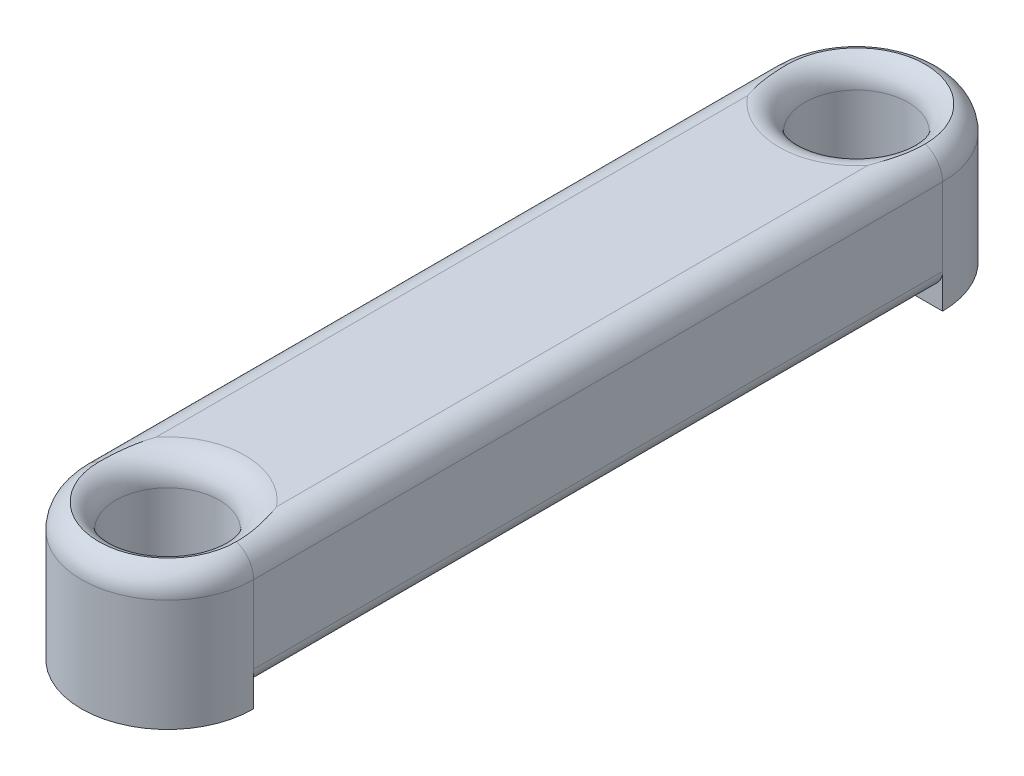
ISO-10303-21;
HEADER;
FILE_DESCRIPTION(('STEP AP214'),'2;1');
FILE_NAME('part.step','',(''),(''),'','','');
FILE_SCHEMA(('AUTOMOTIVE_DESIGN { 1 0 10303 214 1 1 1 1 }'));
ENDSEC;
DATA;
#1=APPLICATION_CONTEXT('core data for automotive mechanical design processes');
#2=APPLICATION_PROTOCOL_DEFINITION('international standard','automotive_design',2000,#1);
#3=PRODUCT_CONTEXT('',#1,'mechanical');
#4=PRODUCT('Part','Part','',(#3));
#5=PRODUCT_RELATED_PRODUCT_CATEGORY('part','',(#4));
#6=PRODUCT_DEFINITION_FORMATION('','',#4);
#7=PRODUCT_DEFINITION_CONTEXT('part definition',#1,'design');
#8=PRODUCT_DEFINITION('design','',#6,#7);
#9=PRODUCT_DEFINITION_SHAPE('','',#8);
#10=(LENGTH_UNIT() NAMED_UNIT(*) SI_UNIT(.MILLI.,.METRE.));
#11=(NAMED_UNIT(*) PLANE_ANGLE_UNIT() SI_UNIT($,.RADIAN.));
#12=(NAMED_UNIT(*) SI_UNIT($,.STERADIAN.) SOLID_ANGLE_UNIT());
#13=UNCERTAINTY_MEASURE_WITH_UNIT(LENGTH_MEASURE(1.E-05),#10,'distance_accuracy_value','');
#14=(GEOMETRIC_REPRESENTATION_CONTEXT(3) GLOBAL_UNCERTAINTY_ASSIGNED_CONTEXT((#13)) GLOBAL_UNIT_ASSIGNED_CONTEXT((#10,
#11,#12)) REPRESENTATION_CONTEXT('',''));
#15=CARTESIAN_POINT('',(0.,0.,0.));
#16=DIRECTION('',(0.,0.,1.));
#17=DIRECTION('',(1.,0.,0.));
#18=AXIS2_PLACEMENT_3D('',#15,#16,#17);
#19=CARTESIAN_POINT('',(0.,0.,10.));
#20=DIRECTION('',(0.,1.,0.));
#21=DIRECTION('',(0.,0.,1.));
#22=AXIS2_PLACEMENT_3D('',#19,#20,#21);
#23=PLANE('',#22);
#24=DIRECTION('',(1.,0.,0.));
#25=VECTOR('',#24,1.);
#26=CARTESIAN_POINT('',(-2.5,0.,10.));
#27=LINE('',#26,#25);
#28=CARTESIAN_POINT('',(1.5,0.,10.));
#29=VERTEX_POINT('',#28);
#30=CARTESIAN_POINT('',(2.5,0.,10.));
#31=VERTEX_POINT('',#30);
#32=EDGE_CURVE('E455',#29,#31,#27,.T.);
#33=ORIENTED_EDGE('',*,*,#32,.T.);
#34=CARTESIAN_POINT('',(0.,0.,10.));
#35=DIRECTION('',(0.,1.,0.));
#36=DIRECTION('',(0.,0.,1.));
#37=AXIS2_PLACEMENT_3D('',#34,#35,#36);
#38=CIRCLE('',#37,2.5);
#39=CARTESIAN_POINT('',(-2.5,0.,10.));
#40=VERTEX_POINT('',#39);
#41=EDGE_CURVE('E431',#40,#31,#38,.T.);
#42=ORIENTED_EDGE('',*,*,#41,.F.);
#43=CARTESIAN_POINT('',(-1.5,0.,10.));
#44=VERTEX_POINT('',#43);
#45=EDGE_CURVE('E450',#40,#44,#27,.T.);
#46=ORIENTED_EDGE('',*,*,#45,.T.);
#47=CARTESIAN_POINT('',(0.,0.,10.));
#48=DIRECTION('',(0.,1.,0.));
#49=DIRECTION('',(0.,0.,1.));
#50=AXIS2_PLACEMENT_3D('',#47,#48,#49);
#51=CIRCLE('',#50,1.5);
#52=EDGE_CURVE('E427',#44,#29,#51,.T.);
#53=ORIENTED_EDGE('',*,*,#52,.T.);
#54=EDGE_LOOP('',(#33,#42,#46,#53));
#55=FACE_BOUND('',#54,.T.);
#56=ADVANCED_FACE('F39',(#55),#23,.F.);
#57=CARTESIAN_POINT('',(2.5,4.,10.));
#58=DIRECTION('',(-1.,0.,0.));
#59=DIRECTION('',(0.,0.,1.));
#60=AXIS2_PLACEMENT_3D('',#57,#58,#59);
#61=PLANE('',#60);
#62=DIRECTION('',(0.,-1.,0.));
#63=VECTOR('',#62,1.);
#64=CARTESIAN_POINT('',(2.5,4.,-10.));
#65=LINE('',#64,#63);
#66=CARTESIAN_POINT('',(2.5,3.25,-10.));
#67=VERTEX_POINT('',#66);
#68=CARTESIAN_POINT('',(2.5,1.,-10.));
#69=VERTEX_POINT('',#68);
#70=EDGE_CURVE('E298',#67,#69,#65,.T.);
#71=ORIENTED_EDGE('',*,*,#70,.F.);
#72=DIRECTION('',(0.,0.,-1.));
#73=VECTOR('',#72,1.);
#74=CARTESIAN_POINT('',(2.5,3.25,10.));
#75=LINE('',#74,#73);
#76=CARTESIAN_POINT('',(2.5,3.25,10.));
#77=VERTEX_POINT('',#76);
#78=EDGE_CURVE('E59',#67,#77,#75,.F.);
#79=ORIENTED_EDGE('',*,*,#78,.T.);
#80=DIRECTION('',(0.,-1.,0.));
#81=VECTOR('',#80,1.);
#82=CARTESIAN_POINT('',(2.5,4.,10.));
#83=LINE('',#82,#81);
#84=CARTESIAN_POINT('',(2.5,1.,10.));
#85=VERTEX_POINT('',#84);
#86=EDGE_CURVE('E169',#77,#85,#83,.T.);
#87=ORIENTED_EDGE('',*,*,#86,.T.);
#88=DIRECTION('',(0.,0.,-1.));
#89=VECTOR('',#88,1.);
#90=CARTESIAN_POINT('',(2.5,1.,-10.));
#91=LINE('',#90,#89);
#92=EDGE_CURVE('E303',#85,#69,#91,.T.);
#93=ORIENTED_EDGE('',*,*,#92,.T.);
#94=EDGE_LOOP('',(#71,#79,#87,#93));
#95=FACE_BOUND('',#94,.T.);
#96=ADVANCED_FACE('F301',(#95),#61,.F.);
#97=CARTESIAN_POINT('',(-2.5,4.,10.));
#98=DIRECTION('',(1.,0.,0.));
#99=DIRECTION('',(0.,0.,-1.));
#100=AXIS2_PLACEMENT_3D('',#97,#98,#99);
#101=PLANE('',#100);
#102=DIRECTION('',(0.,-1.,0.));
#103=VECTOR('',#102,1.);
#104=CARTESIAN_POINT('',(-2.5,4.,10.));
#105=LINE('',#104,#103);
#106=CARTESIAN_POINT('',(-2.5,3.25,10.));
#107=VERTEX_POINT('',#106);
#108=CARTESIAN_POINT('',(-2.5,1.,10.));
#109=VERTEX_POINT('',#108);
#110=EDGE_CURVE('E166',#107,#109,#105,.T.);
#111=ORIENTED_EDGE('',*,*,#110,.F.);
#112=DIRECTION('',(0.,0.,1.));
#113=VECTOR('',#112,1.);
#114=CARTESIAN_POINT('',(-2.5,3.25,-10.));
#115=LINE('',#114,#113);
#116=CARTESIAN_POINT('',(-2.5,3.25,-10.));
#117=VERTEX_POINT('',#116);
#118=EDGE_CURVE('E178',#107,#117,#115,.F.);
#119=ORIENTED_EDGE('',*,*,#118,.T.);
#120=DIRECTION('',(0.,-1.,0.));
#121=VECTOR('',#120,1.);
#122=CARTESIAN_POINT('',(-2.5,4.,-10.));
#123=LINE('',#122,#121);
#124=CARTESIAN_POINT('',(-2.5,1.,-10.));
#125=VERTEX_POINT('',#124);
#126=EDGE_CURVE('E184',#117,#125,#123,.T.);
#127=ORIENTED_EDGE('',*,*,#126,.T.);
#128=DIRECTION('',(0.,0.,-1.));
#129=VECTOR('',#128,1.);
#130=CARTESIAN_POINT('',(-2.5,1.,10.));
#131=LINE('',#130,#129);
#132=EDGE_CURVE('E181',#125,#109,#131,.F.);
#133=ORIENTED_EDGE('',*,*,#132,.T.);
#134=EDGE_LOOP('',(#111,#119,#127,#133));
#135=FACE_BOUND('',#134,.T.);
#136=ADVANCED_FACE('F176',(#135),#101,.F.);
#137=CARTESIAN_POINT('',(0.,4.,10.));
#138=DIRECTION('',(0.,-1.,0.));
#139=DIRECTION('',(0.,0.,-1.));
#140=AXIS2_PLACEMENT_3D('',#137,#138,#139);
#141=CYLINDRICAL_SURFACE('',#140,1.5);
#142=CARTESIAN_POINT('',(0.,3.25,10.));
#143=DIRECTION('',(0.,1.,0.));
#144=DIRECTION('',(0.,0.,1.));
#145=AXIS2_PLACEMENT_3D('',#142,#143,#144);
#146=CIRCLE('',#145,1.5);
#147=CARTESIAN_POINT('',(0.,3.25,11.5));
#148=VERTEX_POINT('',#147);
#149=EDGE_CURVE('E11',#148,#148,#146,.T.);
#150=ORIENTED_EDGE('',*,*,#149,.T.);
#151=EDGE_LOOP('',(#150));
#152=FACE_BOUND('',#151,.T.);
#153=CARTESIAN_POINT('',(0.,0.5,10.));
#154=DIRECTION('',(0.,-1.,0.));
#155=DIRECTION('',(0.,0.,-1.));
#156=AXIS2_PLACEMENT_3D('',#153,#154,#155);
#157=CIRCLE('',#156,1.5);
#158=CARTESIAN_POINT('',(-1.5,0.5,10.));
#159=VERTEX_POINT('',#158);
#160=CARTESIAN_POINT('',(1.5,0.5,10.));
#161=VERTEX_POINT('',#160);
#162=EDGE_CURVE('E416',#159,#161,#157,.T.);
#163=ORIENTED_EDGE('',*,*,#162,.T.);
#164=DIRECTION('',(0.,-1.,0.));
#165=VECTOR('',#164,1.);
#166=CARTESIAN_POINT('',(1.5,4.,10.));
#167=LINE('',#166,#165);
#168=EDGE_CURVE('E326',#161,#29,#167,.T.);
#169=ORIENTED_EDGE('',*,*,#168,.T.);
#170=ORIENTED_EDGE('',*,*,#52,.F.);
#171=DIRECTION('',(0.,-1.,0.));
#172=VECTOR('',#171,1.);
#173=CARTESIAN_POINT('',(-1.5,4.,10.));
#174=LINE('',#173,#172);
#175=EDGE_CURVE('E322',#44,#159,#174,.F.);
#176=ORIENTED_EDGE('',*,*,#175,.T.);
#177=EDGE_LOOP('',(#163,#169,#170,#176));
#178=FACE_BOUND('',#177,.T.);
#179=ADVANCED_FACE('F363',(#152,#178),#141,.F.);
#180=CARTESIAN_POINT('',(0.,4.,10.));
#181=DIRECTION('',(0.,1.,0.));
#182=DIRECTION('',(0.,0.,1.));
#183=AXIS2_PLACEMENT_3D('',#180,#181,#182);
#184=PLANE('',#183);
#185=DIRECTION('',(0.,0.,-1.));
#186=VECTOR('',#185,1.);
#187=CARTESIAN_POINT('',(1.75,4.,-10.));
#188=LINE('',#187,#186);
#189=CARTESIAN_POINT('',(1.75,4.,8.5857864376269));
#190=VERTEX_POINT('',#189);
#191=CARTESIAN_POINT('',(1.75,4.,-8.5857864376269));
#192=VERTEX_POINT('',#191);
#193=EDGE_CURVE('E279',#190,#192,#188,.T.);
#194=ORIENTED_EDGE('',*,*,#193,.T.);
#195=CARTESIAN_POINT('',(0.,4.,-10.));
#196=DIRECTION('',(0.,1.,0.));
#197=DIRECTION('',(0.,0.,1.));
#198=AXIS2_PLACEMENT_3D('',#195,#196,#197);
#199=CIRCLE('',#198,2.25);
#200=CARTESIAN_POINT('',(0.,4.,-7.75));
#201=VERTEX_POINT('',#200);
#202=EDGE_CURVE('E200',#192,#201,#199,.F.);
#203=ORIENTED_EDGE('',*,*,#202,.T.);
#204=CARTESIAN_POINT('',(0.,4.,-10.));
#205=DIRECTION('',(0.,1.,0.));
#206=DIRECTION('',(0.,0.,1.));
#207=AXIS2_PLACEMENT_3D('',#204,#205,#206);
#208=CIRCLE('',#207,2.25);
#209=CARTESIAN_POINT('',(-1.75,4.,-8.58578643762691));
#210=VERTEX_POINT('',#209);
#211=EDGE_CURVE('E206',#201,#210,#208,.F.);
#212=ORIENTED_EDGE('',*,*,#211,.T.);
#213=DIRECTION('',(0.,0.,1.));
#214=VECTOR('',#213,1.);
#215=CARTESIAN_POINT('',(-1.75,4.,10.));
#216=LINE('',#215,#214);
#217=CARTESIAN_POINT('',(-1.75,4.,8.5857864376269));
#218=VERTEX_POINT('',#217);
#219=EDGE_CURVE('E287',#210,#218,#216,.T.);
#220=ORIENTED_EDGE('',*,*,#219,.T.);
#221=CARTESIAN_POINT('',(0.,4.,10.));
#222=DIRECTION('',(0.,1.,0.));
#223=DIRECTION('',(0.,0.,1.));
#224=AXIS2_PLACEMENT_3D('',#221,#222,#223);
#225=CIRCLE('',#224,2.25);
#226=EDGE_CURVE('E281',#218,#190,#225,.F.);
#227=ORIENTED_EDGE('',*,*,#226,.T.);
#228=EDGE_LOOP('',(#194,#203,#212,#220,#227));
#229=FACE_BOUND('',#228,.T.);
#230=ADVANCED_FACE('F360',(#229),#184,.T.);
#231=CARTESIAN_POINT('',(0.,0.,-10.));
#232=DIRECTION('',(0.,1.,0.));
#233=DIRECTION('',(0.,0.,1.));
#234=AXIS2_PLACEMENT_3D('',#231,#232,#233);
#235=CIRCLE('',#234,2.5);
#236=CARTESIAN_POINT('',(2.5,0.,-10.));
#237=VERTEX_POINT('',#236);
#238=CARTESIAN_POINT('',(-2.50000000000001,0.,-10.));
#239=VERTEX_POINT('',#238);
#240=EDGE_CURVE('E185',#237,#239,#235,.T.);
#241=ORIENTED_EDGE('',*,*,#240,.F.);
#242=DIRECTION('',(1.,0.,0.));
#243=VECTOR('',#242,1.);
#244=CARTESIAN_POINT('',(-2.50000000000001,0.,-10.));
#245=LINE('',#244,#243);
#246=CARTESIAN_POINT('',(1.5,0.,-10.));
#247=VERTEX_POINT('',#246);
#248=EDGE_CURVE('E88',#247,#237,#245,.T.);
#249=ORIENTED_EDGE('',*,*,#248,.F.);
#250=CARTESIAN_POINT('',(0.,0.,-10.));
#251=DIRECTION('',(0.,1.,0.));
#252=DIRECTION('',(0.,0.,1.));
#253=AXIS2_PLACEMENT_3D('',#250,#251,#252);
#254=CIRCLE('',#253,1.5);
#255=CARTESIAN_POINT('',(-1.5,0.,-10.));
#256=VERTEX_POINT('',#255);
#257=EDGE_CURVE('E423',#247,#256,#254,.T.);
#258=ORIENTED_EDGE('',*,*,#257,.T.);
#259=EDGE_CURVE('E443',#239,#256,#245,.T.);
#260=ORIENTED_EDGE('',*,*,#259,.F.);
#261=EDGE_LOOP('',(#241,#249,#258,#260));
#262=FACE_BOUND('',#261,.T.);
#263=ADVANCED_FACE('F362',(#262),#23,.F.);
#264=CARTESIAN_POINT('',(0.,4.,10.));
#265=DIRECTION('',(0.,-1.,0.));
#266=DIRECTION('',(0.,0.,-1.));
#267=AXIS2_PLACEMENT_3D('',#264,#265,#266);
#268=CYLINDRICAL_SURFACE('',#267,2.5);
#269=ORIENTED_EDGE('',*,*,#86,.F.);
#270=CARTESIAN_POINT('',(0.,3.25,10.));
#271=DIRECTION('',(0.,1.,0.));
#272=DIRECTION('',(0.,0.,1.));
#273=AXIS2_PLACEMENT_3D('',#270,#271,#272);
#274=CIRCLE('',#273,2.5);
#275=EDGE_CURVE('E50',#77,#107,#274,.F.);
#276=ORIENTED_EDGE('',*,*,#275,.T.);
#277=ORIENTED_EDGE('',*,*,#110,.T.);
#278=DIRECTION('',(0.,1.,0.));
#279=VECTOR('',#278,1.);
#280=CARTESIAN_POINT('',(-2.5,0.,10.));
#281=LINE('',#280,#279);
#282=EDGE_CURVE('E458',#40,#109,#281,.T.);
#283=ORIENTED_EDGE('',*,*,#282,.F.);
#284=ORIENTED_EDGE('',*,*,#41,.T.);
#285=DIRECTION('',(0.,1.,0.));
#286=VECTOR('',#285,1.);
#287=CARTESIAN_POINT('',(2.5,0.,10.));
#288=LINE('',#287,#286);
#289=EDGE_CURVE('E404',#31,#85,#288,.T.);
#290=ORIENTED_EDGE('',*,*,#289,.T.);
#291=EDGE_LOOP('',(#269,#276,#277,#283,#284,#290));
#292=FACE_BOUND('',#291,.T.);
#293=ADVANCED_FACE('F164',(#292),#268,.T.);
#294=CARTESIAN_POINT('',(0.,4.,-10.));
#295=DIRECTION('',(0.,-1.,0.));
#296=DIRECTION('',(0.,0.,-1.));
#297=AXIS2_PLACEMENT_3D('',#294,#295,#296);
#298=CYLINDRICAL_SURFACE('',#297,2.5);
#299=ORIENTED_EDGE('',*,*,#126,.F.);
#300=CARTESIAN_POINT('',(0.,3.25,-10.));
#301=DIRECTION('',(0.,1.,0.));
#302=DIRECTION('',(0.,0.,1.));
#303=AXIS2_PLACEMENT_3D('',#300,#301,#302);
#304=CIRCLE('',#303,2.5);
#305=EDGE_CURVE('E199',#117,#67,#304,.F.);
#306=ORIENTED_EDGE('',*,*,#305,.T.);
#307=ORIENTED_EDGE('',*,*,#70,.T.);
#308=DIRECTION('',(0.,1.,0.));
#309=VECTOR('',#308,1.);
#310=CARTESIAN_POINT('',(2.5,0.,-10.));
#311=LINE('',#310,#309);
#312=EDGE_CURVE('E440',#237,#69,#311,.T.);
#313=ORIENTED_EDGE('',*,*,#312,.F.);
#314=ORIENTED_EDGE('',*,*,#240,.T.);
#315=DIRECTION('',(0.,1.,0.));
#316=VECTOR('',#315,1.);
#317=CARTESIAN_POINT('',(-2.50000000000001,0.,-10.));
#318=LINE('',#317,#316);
#319=EDGE_CURVE('E439',#239,#125,#318,.T.);
#320=ORIENTED_EDGE('',*,*,#319,.T.);
#321=EDGE_LOOP('',(#299,#306,#307,#313,#314,#320));
#322=FACE_BOUND('',#321,.T.);
#323=ADVANCED_FACE('F297',(#322),#298,.T.);
#324=CARTESIAN_POINT('',(0.,4.,-10.));
#325=DIRECTION('',(0.,-1.,0.));
#326=DIRECTION('',(0.,0.,-1.));
#327=AXIS2_PLACEMENT_3D('',#324,#325,#326);
#328=CYLINDRICAL_SURFACE('',#327,1.5);
#329=CARTESIAN_POINT('',(0.,3.25,-10.));
#330=DIRECTION('',(0.,1.,0.));
#331=DIRECTION('',(0.,0.,1.));
#332=AXIS2_PLACEMENT_3D('',#329,#330,#331);
#333=CIRCLE('',#332,1.5);
#334=CARTESIAN_POINT('',(0.,3.25,-8.5));
#335=VERTEX_POINT('',#334);
#336=EDGE_CURVE('E284',#335,#335,#333,.T.);
#337=ORIENTED_EDGE('',*,*,#336,.T.);
#338=EDGE_LOOP('',(#337));
#339=FACE_BOUND('',#338,.T.);
#340=DIRECTION('',(0.,-1.,0.));
#341=VECTOR('',#340,1.);
#342=CARTESIAN_POINT('',(1.5,4.,-10.));
#343=LINE('',#342,#341);
#344=CARTESIAN_POINT('',(1.5,0.5,-10.));
#345=VERTEX_POINT('',#344);
#346=EDGE_CURVE('E319',#345,#247,#343,.T.);
#347=ORIENTED_EDGE('',*,*,#346,.F.);
#348=CARTESIAN_POINT('',(0.,0.5,-10.));
#349=DIRECTION('',(0.,-1.,0.));
#350=DIRECTION('',(0.,0.,-1.));
#351=AXIS2_PLACEMENT_3D('',#348,#349,#350);
#352=CIRCLE('',#351,1.5);
#353=CARTESIAN_POINT('',(-1.5,0.5,-10.));
#354=VERTEX_POINT('',#353);
#355=EDGE_CURVE('E315',#345,#354,#352,.T.);
#356=ORIENTED_EDGE('',*,*,#355,.T.);
#357=DIRECTION('',(0.,-1.,0.));
#358=VECTOR('',#357,1.);
#359=CARTESIAN_POINT('',(-1.5,4.,-10.));
#360=LINE('',#359,#358);
#361=EDGE_CURVE('E308',#256,#354,#360,.F.);
#362=ORIENTED_EDGE('',*,*,#361,.F.);
#363=ORIENTED_EDGE('',*,*,#257,.F.);
#364=EDGE_LOOP('',(#347,#356,#362,#363));
#365=FACE_BOUND('',#364,.T.);
#366=ADVANCED_FACE('F384',(#339,#365),#328,.F.);
#367=CARTESIAN_POINT('',(-2.5,0.,10.));
#368=DIRECTION('',(0.,0.,-1.));
#369=DIRECTION('',(-1.,0.,0.));
#370=AXIS2_PLACEMENT_3D('',#367,#368,#369);
#371=PLANE('',#370);
#372=DIRECTION('',(1.,0.,0.));
#373=VECTOR('',#372,1.);
#374=CARTESIAN_POINT('',(-2.5,0.5,10.));
#375=LINE('',#374,#373);
#376=CARTESIAN_POINT('',(2.,0.5,10.));
#377=VERTEX_POINT('',#376);
#378=EDGE_CURVE('E406',#161,#377,#375,.T.);
#379=ORIENTED_EDGE('',*,*,#378,.T.);
#380=CARTESIAN_POINT('',(2.,1.,10.));
#381=DIRECTION('',(0.,0.,-1.));
#382=DIRECTION('',(-1.,0.,0.));
#383=AXIS2_PLACEMENT_3D('',#380,#381,#382);
#384=CIRCLE('',#383,0.5);
#385=EDGE_CURVE('E351',#377,#85,#384,.F.);
#386=ORIENTED_EDGE('',*,*,#385,.T.);
#387=ORIENTED_EDGE('',*,*,#289,.F.);
#388=ORIENTED_EDGE('',*,*,#32,.F.);
#389=ORIENTED_EDGE('',*,*,#168,.F.);
#390=EDGE_LOOP('',(#379,#386,#387,#388,#389));
#391=FACE_BOUND('',#390,.T.);
#392=ADVANCED_FACE('F403',(#391),#371,.T.);
#393=CARTESIAN_POINT('',(-2.50000000000001,0.,-10.));
#394=DIRECTION('',(0.,0.,-1.));
#395=DIRECTION('',(-1.,0.,0.));
#396=AXIS2_PLACEMENT_3D('',#393,#394,#395);
#397=PLANE('',#396);
#398=ORIENTED_EDGE('',*,*,#346,.T.);
#399=ORIENTED_EDGE('',*,*,#248,.T.);
#400=ORIENTED_EDGE('',*,*,#312,.T.);
#401=CARTESIAN_POINT('',(2.,1.,-10.));
#402=DIRECTION('',(0.,0.,-1.));
#403=DIRECTION('',(-1.,0.,0.));
#404=AXIS2_PLACEMENT_3D('',#401,#402,#403);
#405=CIRCLE('',#404,0.5);
#406=CARTESIAN_POINT('',(2.,0.5,-10.));
#407=VERTEX_POINT('',#406);
#408=EDGE_CURVE('E348',#69,#407,#405,.T.);
#409=ORIENTED_EDGE('',*,*,#408,.T.);
#410=DIRECTION('',(1.,0.,0.));
#411=VECTOR('',#410,1.);
#412=CARTESIAN_POINT('',(-2.50000000000001,0.5,-10.));
#413=LINE('',#412,#411);
#414=EDGE_CURVE('E417',#345,#407,#413,.T.);
#415=ORIENTED_EDGE('',*,*,#414,.F.);
#416=EDGE_LOOP('',(#398,#399,#400,#409,#415));
#417=FACE_BOUND('',#416,.T.);
#418=ADVANCED_FACE('F478',(#417),#397,.F.);
#419=ORIENTED_EDGE('',*,*,#45,.F.);
#420=ORIENTED_EDGE('',*,*,#282,.T.);
#421=CARTESIAN_POINT('',(-2.,1.,10.));
#422=DIRECTION('',(0.,0.,-1.));
#423=DIRECTION('',(-1.,0.,0.));
#424=AXIS2_PLACEMENT_3D('',#421,#422,#423);
#425=CIRCLE('',#424,0.5);
#426=CARTESIAN_POINT('',(-2.,0.5,10.));
#427=VERTEX_POINT('',#426);
#428=EDGE_CURVE('E345',#109,#427,#425,.F.);
#429=ORIENTED_EDGE('',*,*,#428,.T.);
#430=EDGE_CURVE('E411',#427,#159,#375,.T.);
#431=ORIENTED_EDGE('',*,*,#430,.T.);
#432=ORIENTED_EDGE('',*,*,#175,.F.);
#433=EDGE_LOOP('',(#419,#420,#429,#431,#432));
#434=FACE_BOUND('',#433,.T.);
#435=ADVANCED_FACE('F466',(#434),#371,.T.);
#436=CARTESIAN_POINT('',(-2.5,0.5,10.));
#437=DIRECTION('',(0.,-1.,0.));
#438=DIRECTION('',(0.,0.,-1.));
#439=AXIS2_PLACEMENT_3D('',#436,#437,#438);
#440=PLANE('',#439);
#441=ORIENTED_EDGE('',*,*,#430,.F.);
#442=DIRECTION('',(0.,0.,-1.));
#443=VECTOR('',#442,1.);
#444=CARTESIAN_POINT('',(-2.,0.5,-10.));
#445=LINE('',#444,#443);
#446=CARTESIAN_POINT('',(-2.,0.5,-10.));
#447=VERTEX_POINT('',#446);
#448=EDGE_CURVE('E333',#427,#447,#445,.T.);
#449=ORIENTED_EDGE('',*,*,#448,.T.);
#450=EDGE_CURVE('E412',#447,#354,#413,.T.);
#451=ORIENTED_EDGE('',*,*,#450,.T.);
#452=ORIENTED_EDGE('',*,*,#355,.F.);
#453=ORIENTED_EDGE('',*,*,#414,.T.);
#454=DIRECTION('',(0.,0.,-1.));
#455=VECTOR('',#454,1.);
#456=CARTESIAN_POINT('',(2.,0.5,10.));
#457=LINE('',#456,#455);
#458=EDGE_CURVE('E330',#407,#377,#457,.F.);
#459=ORIENTED_EDGE('',*,*,#458,.T.);
#460=ORIENTED_EDGE('',*,*,#378,.F.);
#461=ORIENTED_EDGE('',*,*,#162,.F.);
#462=EDGE_LOOP('',(#441,#449,#451,#452,#453,#459,#460,#461));
#463=FACE_BOUND('',#462,.T.);
#464=ADVANCED_FACE('F472',(#463),#440,.T.);
#465=ORIENTED_EDGE('',*,*,#361,.T.);
#466=ORIENTED_EDGE('',*,*,#450,.F.);
#467=CARTESIAN_POINT('',(-2.,1.,-10.));
#468=DIRECTION('',(0.,0.,-1.));
#469=DIRECTION('',(-1.,0.,0.));
#470=AXIS2_PLACEMENT_3D('',#467,#468,#469);
#471=CIRCLE('',#470,0.5);
#472=EDGE_CURVE('E341',#447,#125,#471,.T.);
#473=ORIENTED_EDGE('',*,*,#472,.T.);
#474=ORIENTED_EDGE('',*,*,#319,.F.);
#475=ORIENTED_EDGE('',*,*,#259,.T.);
#476=EDGE_LOOP('',(#465,#466,#473,#474,#475));
#477=FACE_BOUND('',#476,.T.);
#478=ADVANCED_FACE('F391',(#477),#397,.F.);
#479=CARTESIAN_POINT('',(-2.,1.,10.));
#480=DIRECTION('',(0.,0.,1.));
#481=DIRECTION('',(1.,0.,0.));
#482=AXIS2_PLACEMENT_3D('',#479,#480,#481);
#483=CYLINDRICAL_SURFACE('',#482,0.5);
#484=ORIENTED_EDGE('',*,*,#428,.F.);
#485=ORIENTED_EDGE('',*,*,#132,.F.);
#486=ORIENTED_EDGE('',*,*,#472,.F.);
#487=ORIENTED_EDGE('',*,*,#448,.F.);
#488=EDGE_LOOP('',(#484,#485,#486,#487));
#489=FACE_BOUND('',#488,.T.);
#490=ADVANCED_FACE('F388',(#489),#483,.T.);
#491=CARTESIAN_POINT('',(2.,1.,10.));
#492=DIRECTION('',(0.,0.,1.));
#493=DIRECTION('',(1.,0.,0.));
#494=AXIS2_PLACEMENT_3D('',#491,#492,#493);
#495=CYLINDRICAL_SURFACE('',#494,0.5);
#496=ORIENTED_EDGE('',*,*,#385,.F.);
#497=ORIENTED_EDGE('',*,*,#458,.F.);
#498=ORIENTED_EDGE('',*,*,#408,.F.);
#499=ORIENTED_EDGE('',*,*,#92,.F.);
#500=EDGE_LOOP('',(#496,#497,#498,#499));
#501=FACE_BOUND('',#500,.T.);
#502=ADVANCED_FACE('F390',(#501),#495,.T.);
#503=CARTESIAN_POINT('',(0.,3.25,10.));
#504=DIRECTION('',(0.,1.,0.));
#505=DIRECTION('',(0.,0.,1.));
#506=AXIS2_PLACEMENT_3D('',#503,#504,#505);
#507=TOROIDAL_SURFACE('',#506,1.75,0.75);
#508=CARTESIAN_POINT('',(0.,3.95710678118655,10.));
#509=DIRECTION('',(0.,-1.,0.));
#510=DIRECTION('',(0.,0.,-1.));
#511=AXIS2_PLACEMENT_3D('',#508,#509,#510);
#512=CIRCLE('',#511,2.);
#513=CARTESIAN_POINT('',(-2.,3.95710678118655,10.));
#514=VERTEX_POINT('',#513);
#515=CARTESIAN_POINT('',(2.,3.95710678118655,10.));
#516=VERTEX_POINT('',#515);
#517=EDGE_CURVE('E43',#514,#516,#512,.F.);
#518=ORIENTED_EDGE('',*,*,#517,.F.);
#519=CARTESIAN_POINT('',(-1.75,3.25,10.));
#520=DIRECTION('',(0.,0.,-1.));
#521=DIRECTION('',(-1.,0.,0.));
#522=AXIS2_PLACEMENT_3D('',#519,#520,#521);
#523=CIRCLE('',#522,0.75);
#524=EDGE_CURVE('E188',#107,#514,#523,.T.);
#525=ORIENTED_EDGE('',*,*,#524,.F.);
#526=ORIENTED_EDGE('',*,*,#275,.F.);
#527=CARTESIAN_POINT('',(1.75,3.25,10.));
#528=DIRECTION('',(0.,0.,-1.));
#529=DIRECTION('',(-1.,0.,0.));
#530=AXIS2_PLACEMENT_3D('',#527,#528,#529);
#531=CIRCLE('',#530,0.75);
#532=EDGE_CURVE('E255',#516,#77,#531,.T.);
#533=ORIENTED_EDGE('',*,*,#532,.F.);
#534=EDGE_LOOP('',(#518,#525,#526,#533));
#535=FACE_BOUND('',#534,.T.);
#536=ADVANCED_FACE('F41',(#535),#507,.T.);
#537=CARTESIAN_POINT('',(0.,3.25,10.));
#538=DIRECTION('',(0.,1.,0.));
#539=DIRECTION('',(0.,0.,1.));
#540=AXIS2_PLACEMENT_3D('',#537,#538,#539);
#541=TOROIDAL_SURFACE('',#540,2.25,0.75);
#542=ORIENTED_EDGE('',*,*,#149,.F.);
#543=EDGE_LOOP('',(#542));
#544=FACE_BOUND('',#543,.T.);
#545=CARTESIAN_POINT('',(1.75,4.,8.5857864376269));
#546=CARTESIAN_POINT('',(1.75076762794194,3.99999999188612,8.58795760729975));
#547=CARTESIAN_POINT('',(1.75153368677209,3.99999881372849,8.5901293491788));
#548=CARTESIAN_POINT('',(1.79173694877426,3.99987602971082,8.7043681466517));
#549=CARTESIAN_POINT('',(1.82699100502119,3.9966773036161,8.81795085800763));
#550=CARTESIAN_POINT('',(1.88825841495023,3.98779825791853,9.04756810603884));
#551=CARTESIAN_POINT('',(1.91426337700434,3.98211569511516,9.16360476856923));
#552=CARTESIAN_POINT('',(1.94596392393164,3.97402829770016,9.33984078631071));
#553=CARTESIAN_POINT('',(1.95535272884293,3.97138817063735,9.39937827988109));
#554=CARTESIAN_POINT('',(1.9715052132453,3.96659385262643,9.51883017581381));
#555=CARTESIAN_POINT('',(1.97826897096196,3.96443964719882,9.57874456689064));
#556=CARTESIAN_POINT('',(1.98911336517352,3.9608861934389,9.69884099410182));
#557=CARTESIAN_POINT('',(1.99319391281014,3.95948697010916,9.75902303903346));
#558=CARTESIAN_POINT('',(1.99864109391214,3.95758688945652,9.8795355464071));
#559=CARTESIAN_POINT('',(2.00000718241196,3.95708621253131,9.93986603621775));
#560=CARTESIAN_POINT('',(1.99999999500013,3.95710678295437,10.0002));
#561=B_SPLINE_CURVE_WITH_KNOTS('',3,(#545,#546,#547,#548,#549,#550,#551,#552,#553,#554,#555,
#556,#557,#558,#559,#560),.UNSPECIFIED.,.F.,.F.,(4,2,2,2,2,2,2,4),(0.,0.00690867173584429,
0.363317285576419,0.720048446080618,0.900989989780974,1.08192614106694,1.26286828400583,
1.4438467499352),.UNSPECIFIED.);
#562=EDGE_CURVE('E245',#190,#516,#561,.T.);
#563=ORIENTED_EDGE('',*,*,#562,.F.);
#564=ORIENTED_EDGE('',*,*,#226,.F.);
#565=CARTESIAN_POINT('',(-1.999999995,3.95710678295431,10.0002));
#566=CARTESIAN_POINT('',(-2.00000718241182,3.95708621253129,9.93986603621853));
#567=CARTESIAN_POINT('',(-1.99864109391211,3.95758688945651,9.87953554640857));
#568=CARTESIAN_POINT('',(-1.99319391281035,3.95948697010912,9.75902303903585));
#569=CARTESIAN_POINT('',(-1.98911336517381,3.96088619343884,9.69884099410443));
#570=CARTESIAN_POINT('',(-1.97826897096174,3.96443964719886,9.57874456688885));
#571=CARTESIAN_POINT('',(-1.97150521324425,3.96659385262666,9.5188301758074));
#572=CARTESIAN_POINT('',(-1.955352728841,3.97138817063801,9.39937827986546));
#573=CARTESIAN_POINT('',(-1.94596392392969,3.97402829770106,9.33984078629045));
#574=CARTESIAN_POINT('',(-1.91426337699731,3.98211569511616,9.16360476854879));
#575=CARTESIAN_POINT('',(-1.88825841493224,3.98779825791919,9.04756810602499));
#576=CARTESIAN_POINT('',(-1.8269910050315,3.99667730361654,8.81795085799275));
#577=CARTESIAN_POINT('',(-1.79173694882404,3.99987602971146,8.70436814662915));
#578=CARTESIAN_POINT('',(-1.75153368677431,3.99999881372851,8.59012934917879));
#579=CARTESIAN_POINT('',(-1.75076762794307,3.99999999188613,8.58795760729974));
#580=CARTESIAN_POINT('',(-1.75,4.,8.5857864376269));
#581=B_SPLINE_CURVE_WITH_KNOTS('',3,(#565,#566,#567,#568,#569,#570,#571,#572,#573,#574,#575,
#576,#577,#578,#579,#580),.UNSPECIFIED.,.F.,.F.,(4,2,2,2,2,2,2,4),(0.,0.180978465927253,
0.361920608865409,0.542856760165558,0.723798303879117,1.08052946437526,1.43693807819845,
1.44384674993538),.UNSPECIFIED.);
#582=EDGE_CURVE('E192',#514,#218,#581,.T.);
#583=ORIENTED_EDGE('',*,*,#582,.F.);
#584=ORIENTED_EDGE('',*,*,#517,.T.);
#585=EDGE_LOOP('',(#563,#564,#583,#584));
#586=FACE_BOUND('',#585,.T.);
#587=ADVANCED_FACE('F258',(#544,#586),#541,.T.);
#588=CARTESIAN_POINT('',(-1.75,3.25,10.));
#589=DIRECTION('',(0.,0.,-1.));
#590=DIRECTION('',(-1.,0.,0.));
#591=AXIS2_PLACEMENT_3D('',#588,#589,#590);
#592=CYLINDRICAL_SURFACE('',#591,0.75);
#593=CARTESIAN_POINT('',(-1.75,3.25,-10.));
#594=DIRECTION('',(0.,0.,-1.));
#595=DIRECTION('',(-1.,0.,0.));
#596=AXIS2_PLACEMENT_3D('',#593,#594,#595);
#597=CIRCLE('',#596,0.75);
#598=CARTESIAN_POINT('',(-2.,3.95710678118655,-10.));
#599=VERTEX_POINT('',#598);
#600=EDGE_CURVE('E193',#117,#599,#597,.T.);
#601=ORIENTED_EDGE('',*,*,#600,.F.);
#602=ORIENTED_EDGE('',*,*,#118,.F.);
#603=ORIENTED_EDGE('',*,*,#524,.T.);
#604=ORIENTED_EDGE('',*,*,#582,.T.);
#605=ORIENTED_EDGE('',*,*,#219,.F.);
#606=CARTESIAN_POINT('',(-1.999999995,3.95710678295432,-10.0002));
#607=CARTESIAN_POINT('',(-2.00000718241182,3.95708621253129,-9.93986603621853));
#608=CARTESIAN_POINT('',(-1.99864109391211,3.95758688945651,-9.87953554640857));
#609=CARTESIAN_POINT('',(-1.99319391281035,3.95948697010912,-9.75902303903585));
#610=CARTESIAN_POINT('',(-1.98911336517382,3.96088619343884,-9.69884099410444));
#611=CARTESIAN_POINT('',(-1.97826897096174,3.96443964719886,-9.57874456688885));
#612=CARTESIAN_POINT('',(-1.97150521324425,3.96659385262666,-9.5188301758074));
#613=CARTESIAN_POINT('',(-1.955352728841,3.97138817063801,-9.39937827986543));
#614=CARTESIAN_POINT('',(-1.94596392392969,3.97402829770106,-9.33984078629042));
#615=CARTESIAN_POINT('',(-1.9142633769973,3.98211569511616,-9.16360476854875));
#616=CARTESIAN_POINT('',(-1.88825841493221,3.9877982579192,-9.04756810602497));
#617=CARTESIAN_POINT('',(-1.82699100503152,3.99667730361655,-8.81795085799273));
#618=CARTESIAN_POINT('',(-1.79173694882412,3.99987602971146,-8.70436814662912));
#619=CARTESIAN_POINT('',(-1.75153368677431,3.99999881372851,-8.59012934917879));
#620=CARTESIAN_POINT('',(-1.75076762794307,3.99999999188613,-8.58795760729974));
#621=CARTESIAN_POINT('',(-1.75,4.,-8.58578643762691));
#622=B_SPLINE_CURVE_WITH_KNOTS('',3,(#606,#607,#608,#609,#610,#611,#612,#613,#614,#615,#616,
#617,#618,#619,#620,#621),.UNSPECIFIED.,.F.,.F.,(4,2,2,2,2,2,2,4),(0.,0.180978465927249,
0.361920608865402,0.542856760165572,0.723798303879154,1.08052946437529,1.43693807819844,
1.44384674993538),.UNSPECIFIED.);
#623=EDGE_CURVE('E237',#599,#210,#622,.T.);
#624=ORIENTED_EDGE('',*,*,#623,.F.);
#625=EDGE_LOOP('',(#601,#602,#603,#604,#605,#624));
#626=FACE_BOUND('',#625,.T.);
#627=ADVANCED_FACE('F196',(#626),#592,.T.);
#628=CARTESIAN_POINT('',(0.,3.25,-10.));
#629=DIRECTION('',(0.,1.,0.));
#630=DIRECTION('',(0.,0.,1.));
#631=AXIS2_PLACEMENT_3D('',#628,#629,#630);
#632=TOROIDAL_SURFACE('',#631,1.75,0.75);
#633=CARTESIAN_POINT('',(1.75,3.25,-10.));
#634=DIRECTION('',(0.,0.,1.));
#635=DIRECTION('',(1.,0.,0.));
#636=AXIS2_PLACEMENT_3D('',#633,#634,#635);
#637=CIRCLE('',#636,0.75);
#638=CARTESIAN_POINT('',(2.,3.95710678118656,-9.99999999999999));
#639=VERTEX_POINT('',#638);
#640=EDGE_CURVE('E272',#67,#639,#637,.T.);
#641=ORIENTED_EDGE('',*,*,#640,.F.);
#642=ORIENTED_EDGE('',*,*,#305,.F.);
#643=ORIENTED_EDGE('',*,*,#600,.T.);
#644=CARTESIAN_POINT('',(0.,3.95710678118655,-10.));
#645=DIRECTION('',(0.,1.,0.));
#646=DIRECTION('',(0.,0.,1.));
#647=AXIS2_PLACEMENT_3D('',#644,#645,#646);
#648=CIRCLE('',#647,2.);
#649=EDGE_CURVE('E222',#639,#599,#648,.T.);
#650=ORIENTED_EDGE('',*,*,#649,.F.);
#651=EDGE_LOOP('',(#641,#642,#643,#650));
#652=FACE_BOUND('',#651,.T.);
#653=ADVANCED_FACE('F231',(#652),#632,.T.);
#654=CARTESIAN_POINT('',(1.75,3.25,10.));
#655=DIRECTION('',(0.,0.,1.));
#656=DIRECTION('',(1.,0.,0.));
#657=AXIS2_PLACEMENT_3D('',#654,#655,#656);
#658=CYLINDRICAL_SURFACE('',#657,0.75);
#659=ORIENTED_EDGE('',*,*,#78,.F.);
#660=ORIENTED_EDGE('',*,*,#640,.T.);
#661=CARTESIAN_POINT('',(1.75,4.,-8.5857864376269));
#662=CARTESIAN_POINT('',(1.75076762794194,3.99999999188612,-8.58795760729974));
#663=CARTESIAN_POINT('',(1.75153368677208,3.99999881372849,-8.5901293491788));
#664=CARTESIAN_POINT('',(1.79173694877426,3.99987602971082,-8.7043681466517));
#665=CARTESIAN_POINT('',(1.82699100502118,3.99667730361609,-8.81795085800762));
#666=CARTESIAN_POINT('',(1.88825841495023,3.98779825791853,-9.04756810603884));
#667=CARTESIAN_POINT('',(1.91426337700434,3.98211569511516,-9.16360476856923));
#668=CARTESIAN_POINT('',(1.94596392393163,3.97402829770016,-9.33984078631071));
#669=CARTESIAN_POINT('',(1.95535272884292,3.97138817063735,-9.39937827988109));
#670=CARTESIAN_POINT('',(1.9715052132453,3.96659385262643,-9.51883017581381));
#671=CARTESIAN_POINT('',(1.97826897096196,3.96443964719882,-9.57874456689064));
#672=CARTESIAN_POINT('',(1.98911336517352,3.9608861934389,-9.69884099410182));
#673=CARTESIAN_POINT('',(1.99319391281014,3.95948697010916,-9.75902303903346));
#674=CARTESIAN_POINT('',(1.99864109391213,3.95758688945652,-9.8795355464071));
#675=CARTESIAN_POINT('',(2.00000718241196,3.95708621253131,-9.93986603621775));
#676=CARTESIAN_POINT('',(1.99999999500013,3.95710678295437,-10.0002));
#677=B_SPLINE_CURVE_WITH_KNOTS('',3,(#661,#662,#663,#664,#665,#666,#667,#668,#669,#670,#671,
#672,#673,#674,#675,#676),.UNSPECIFIED.,.F.,.F.,(4,2,2,2,2,2,2,4),(0.,0.00690867173584429,
0.363317285576419,0.720048446080622,0.900989989780978,1.08192614106695,1.26286828400584,
1.44384674993521),.UNSPECIFIED.);
#678=EDGE_CURVE('E212',#192,#639,#677,.T.);
#679=ORIENTED_EDGE('',*,*,#678,.F.);
#680=ORIENTED_EDGE('',*,*,#193,.F.);
#681=ORIENTED_EDGE('',*,*,#562,.T.);
#682=ORIENTED_EDGE('',*,*,#532,.T.);
#683=EDGE_LOOP('',(#659,#660,#679,#680,#681,#682));
#684=FACE_BOUND('',#683,.T.);
#685=ADVANCED_FACE('F226',(#684),#658,.T.);
#686=CARTESIAN_POINT('',(0.,3.25,-10.));
#687=DIRECTION('',(0.,1.,0.));
#688=DIRECTION('',(0.,0.,1.));
#689=AXIS2_PLACEMENT_3D('',#686,#687,#688);
#690=TOROIDAL_SURFACE('',#689,2.25,0.75);
#691=ORIENTED_EDGE('',*,*,#649,.T.);
#692=ORIENTED_EDGE('',*,*,#623,.T.);
#693=ORIENTED_EDGE('',*,*,#211,.F.);
#694=ORIENTED_EDGE('',*,*,#202,.F.);
#695=ORIENTED_EDGE('',*,*,#678,.T.);
#696=EDGE_LOOP('',(#691,#692,#693,#694,#695));
#697=FACE_BOUND('',#696,.T.);
#698=ORIENTED_EDGE('',*,*,#336,.F.);
#699=EDGE_LOOP('',(#698));
#700=FACE_BOUND('',#699,.T.);
#701=ADVANCED_FACE('F230',(#697,#700),#690,.T.);
#702=CLOSED_SHELL('',(#56,#96,#136,#179,#230,#263,#293,#323,#366,#392,#418,#435,#464,#478,#490,
#502,#536,#587,#627,#653,#685,#701));
#703=MANIFOLD_SOLID_BREP('B2',#702);
#704=ADVANCED_BREP_SHAPE_REPRESENTATION('',(#18,#703),#14);
#705=SHAPE_DEFINITION_REPRESENTATION(#9,#704);
ENDSEC;
END-ISO-10303-21;
